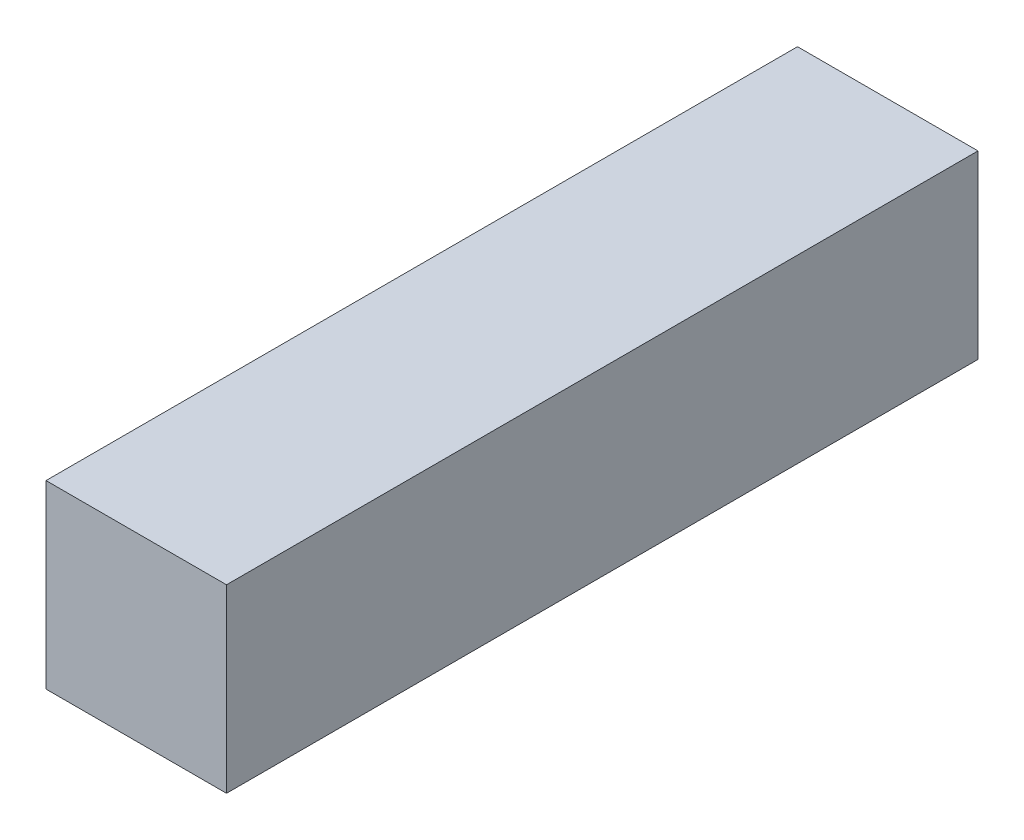
ISO-10303-21;
HEADER;
FILE_DESCRIPTION(('STEP AP214'),'2;1');
FILE_NAME('part.step','',(''),(''),'','','');
FILE_SCHEMA(('AUTOMOTIVE_DESIGN { 1 0 10303 214 1 1 1 1 }'));
ENDSEC;
DATA;
#1=APPLICATION_CONTEXT('core data for automotive mechanical design processes');
#2=APPLICATION_PROTOCOL_DEFINITION('international standard','automotive_design',2000,#1);
#3=PRODUCT_CONTEXT('',#1,'mechanical');
#4=PRODUCT('Part','Part','',(#3));
#5=PRODUCT_RELATED_PRODUCT_CATEGORY('part','',(#4));
#6=PRODUCT_DEFINITION_FORMATION('','',#4);
#7=PRODUCT_DEFINITION_CONTEXT('part definition',#1,'design');
#8=PRODUCT_DEFINITION('design','',#6,#7);
#9=PRODUCT_DEFINITION_SHAPE('','',#8);
#10=(LENGTH_UNIT() NAMED_UNIT(*) SI_UNIT(.MILLI.,.METRE.));
#11=(NAMED_UNIT(*) PLANE_ANGLE_UNIT() SI_UNIT($,.RADIAN.));
#12=(NAMED_UNIT(*) SI_UNIT($,.STERADIAN.) SOLID_ANGLE_UNIT());
#13=UNCERTAINTY_MEASURE_WITH_UNIT(LENGTH_MEASURE(1.E-05),#10,'distance_accuracy_value','');
#14=(GEOMETRIC_REPRESENTATION_CONTEXT(3) GLOBAL_UNCERTAINTY_ASSIGNED_CONTEXT((#13)) GLOBAL_UNIT_ASSIGNED_CONTEXT((#10,
#11,#12)) REPRESENTATION_CONTEXT('',''));
#15=CARTESIAN_POINT('',(0.,0.,0.));
#16=DIRECTION('',(0.,0.,1.));
#17=DIRECTION('',(1.,0.,0.));
#18=AXIS2_PLACEMENT_3D('',#15,#16,#17);
#19=CARTESIAN_POINT('',(0.,0.,19.8272));
#20=DIRECTION('',(1.,0.,0.));
#21=DIRECTION('',(0.,0.,-1.));
#22=AXIS2_PLACEMENT_3D('',#19,#20,#21);
#23=PLANE('',#22);
#24=DIRECTION('',(0.,-1.,0.));
#25=VECTOR('',#24,1.);
#26=CARTESIAN_POINT('',(0.,0.,0.));
#27=LINE('',#26,#25);
#28=CARTESIAN_POINT('',(0.,4.76504,0.));
#29=VERTEX_POINT('',#28);
#30=CARTESIAN_POINT('',(0.,0.,0.));
#31=VERTEX_POINT('',#30);
#32=EDGE_CURVE('E96',#29,#31,#27,.T.);
#33=ORIENTED_EDGE('',*,*,#32,.T.);
#34=DIRECTION('',(0.,0.,-1.));
#35=VECTOR('',#34,1.);
#36=CARTESIAN_POINT('',(0.,0.,19.8272));
#37=LINE('',#36,#35);
#38=CARTESIAN_POINT('',(0.,0.,19.8272));
#39=VERTEX_POINT('',#38);
#40=EDGE_CURVE('E11',#39,#31,#37,.T.);
#41=ORIENTED_EDGE('',*,*,#40,.F.);
#42=DIRECTION('',(0.,-1.,0.));
#43=VECTOR('',#42,1.);
#44=CARTESIAN_POINT('',(0.,0.,19.8272));
#45=LINE('',#44,#43);
#46=CARTESIAN_POINT('',(0.,4.76504,19.8272));
#47=VERTEX_POINT('',#46);
#48=EDGE_CURVE('E84',#47,#39,#45,.T.);
#49=ORIENTED_EDGE('',*,*,#48,.F.);
#50=DIRECTION('',(0.,0.,-1.));
#51=VECTOR('',#50,1.);
#52=CARTESIAN_POINT('',(0.,4.76504,19.8272));
#53=LINE('',#52,#51);
#54=EDGE_CURVE('E92',#47,#29,#53,.T.);
#55=ORIENTED_EDGE('',*,*,#54,.T.);
#56=EDGE_LOOP('',(#33,#41,#49,#55));
#57=FACE_BOUND('',#56,.T.);
#58=ADVANCED_FACE('F33',(#57),#23,.F.);
#59=CARTESIAN_POINT('',(0.,0.,19.8272));
#60=DIRECTION('',(0.,1.,0.));
#61=DIRECTION('',(0.,0.,1.));
#62=AXIS2_PLACEMENT_3D('',#59,#60,#61);
#63=PLANE('',#62);
#64=DIRECTION('',(1.,0.,0.));
#65=VECTOR('',#64,1.);
#66=CARTESIAN_POINT('',(0.,0.,0.));
#67=LINE('',#66,#65);
#68=CARTESIAN_POINT('',(4.7625,0.,0.));
#69=VERTEX_POINT('',#68);
#70=EDGE_CURVE('E88',#31,#69,#67,.T.);
#71=ORIENTED_EDGE('',*,*,#70,.T.);
#72=DIRECTION('',(0.,0.,-1.));
#73=VECTOR('',#72,1.);
#74=CARTESIAN_POINT('',(4.7625,0.,19.8272));
#75=LINE('',#74,#73);
#76=CARTESIAN_POINT('',(4.7625,0.,19.8272));
#77=VERTEX_POINT('',#76);
#78=EDGE_CURVE('E41',#77,#69,#75,.T.);
#79=ORIENTED_EDGE('',*,*,#78,.F.);
#80=DIRECTION('',(1.,0.,0.));
#81=VECTOR('',#80,1.);
#82=CARTESIAN_POINT('',(0.,0.,19.8272));
#83=LINE('',#82,#81);
#84=EDGE_CURVE('E79',#39,#77,#83,.T.);
#85=ORIENTED_EDGE('',*,*,#84,.F.);
#86=ORIENTED_EDGE('',*,*,#40,.T.);
#87=EDGE_LOOP('',(#71,#79,#85,#86));
#88=FACE_BOUND('',#87,.T.);
#89=ADVANCED_FACE('F87',(#88),#63,.F.);
#90=CARTESIAN_POINT('',(4.7625,0.,19.8272));
#91=DIRECTION('',(-1.,0.,0.));
#92=DIRECTION('',(0.,0.,1.));
#93=AXIS2_PLACEMENT_3D('',#90,#91,#92);
#94=PLANE('',#93);
#95=DIRECTION('',(0.,1.,0.));
#96=VECTOR('',#95,1.);
#97=CARTESIAN_POINT('',(4.7625,0.,0.));
#98=LINE('',#97,#96);
#99=CARTESIAN_POINT('',(4.7625,4.76504,0.));
#100=VERTEX_POINT('',#99);
#101=EDGE_CURVE('E66',#69,#100,#98,.T.);
#102=ORIENTED_EDGE('',*,*,#101,.T.);
#103=DIRECTION('',(0.,0.,-1.));
#104=VECTOR('',#103,1.);
#105=CARTESIAN_POINT('',(4.7625,4.76504,19.8272));
#106=LINE('',#105,#104);
#107=CARTESIAN_POINT('',(4.7625,4.76504,19.8272));
#108=VERTEX_POINT('',#107);
#109=EDGE_CURVE('E89',#108,#100,#106,.T.);
#110=ORIENTED_EDGE('',*,*,#109,.F.);
#111=DIRECTION('',(0.,1.,0.));
#112=VECTOR('',#111,1.);
#113=CARTESIAN_POINT('',(4.7625,0.,19.8272));
#114=LINE('',#113,#112);
#115=EDGE_CURVE('E82',#77,#108,#114,.T.);
#116=ORIENTED_EDGE('',*,*,#115,.F.);
#117=ORIENTED_EDGE('',*,*,#78,.T.);
#118=EDGE_LOOP('',(#102,#110,#116,#117));
#119=FACE_BOUND('',#118,.T.);
#120=ADVANCED_FACE('F90',(#119),#94,.F.);
#121=CARTESIAN_POINT('',(0.,4.76504,19.8272));
#122=DIRECTION('',(0.,-1.,0.));
#123=DIRECTION('',(0.,0.,-1.));
#124=AXIS2_PLACEMENT_3D('',#121,#122,#123);
#125=PLANE('',#124);
#126=DIRECTION('',(-1.,0.,0.));
#127=VECTOR('',#126,1.);
#128=CARTESIAN_POINT('',(0.,4.76504,0.));
#129=LINE('',#128,#127);
#130=EDGE_CURVE('E72',#100,#29,#129,.T.);
#131=ORIENTED_EDGE('',*,*,#130,.T.);
#132=ORIENTED_EDGE('',*,*,#54,.F.);
#133=DIRECTION('',(-1.,0.,0.));
#134=VECTOR('',#133,1.);
#135=CARTESIAN_POINT('',(0.,4.76504,19.8272));
#136=LINE('',#135,#134);
#137=EDGE_CURVE('E49',#108,#47,#136,.T.);
#138=ORIENTED_EDGE('',*,*,#137,.F.);
#139=ORIENTED_EDGE('',*,*,#109,.T.);
#140=EDGE_LOOP('',(#131,#132,#138,#139));
#141=FACE_BOUND('',#140,.T.);
#142=ADVANCED_FACE('F103',(#141),#125,.F.);
#143=CARTESIAN_POINT('',(0.,0.,19.8272));
#144=DIRECTION('',(0.,0.,-1.));
#145=DIRECTION('',(-1.,0.,0.));
#146=AXIS2_PLACEMENT_3D('',#143,#144,#145);
#147=PLANE('',#146);
#148=ORIENTED_EDGE('',*,*,#48,.T.);
#149=ORIENTED_EDGE('',*,*,#84,.T.);
#150=ORIENTED_EDGE('',*,*,#115,.T.);
#151=ORIENTED_EDGE('',*,*,#137,.T.);
#152=EDGE_LOOP('',(#148,#149,#150,#151));
#153=FACE_BOUND('',#152,.T.);
#154=ADVANCED_FACE('F80',(#153),#147,.F.);
#155=CARTESIAN_POINT('',(0.,0.,0.));
#156=DIRECTION('',(0.,0.,-1.));
#157=DIRECTION('',(-1.,0.,0.));
#158=AXIS2_PLACEMENT_3D('',#155,#156,#157);
#159=PLANE('',#158);
#160=ORIENTED_EDGE('',*,*,#32,.F.);
#161=ORIENTED_EDGE('',*,*,#130,.F.);
#162=ORIENTED_EDGE('',*,*,#101,.F.);
#163=ORIENTED_EDGE('',*,*,#70,.F.);
#164=EDGE_LOOP('',(#160,#161,#162,#163));
#165=FACE_BOUND('',#164,.T.);
#166=ADVANCED_FACE('F106',(#165),#159,.T.);
#167=CLOSED_SHELL('',(#58,#89,#120,#142,#154,#166));
#168=MANIFOLD_SOLID_BREP('B2',#167);
#169=ADVANCED_BREP_SHAPE_REPRESENTATION('',(#18,#168),#14);
#170=SHAPE_DEFINITION_REPRESENTATION(#9,#169);
ENDSEC;
END-ISO-10303-21;
